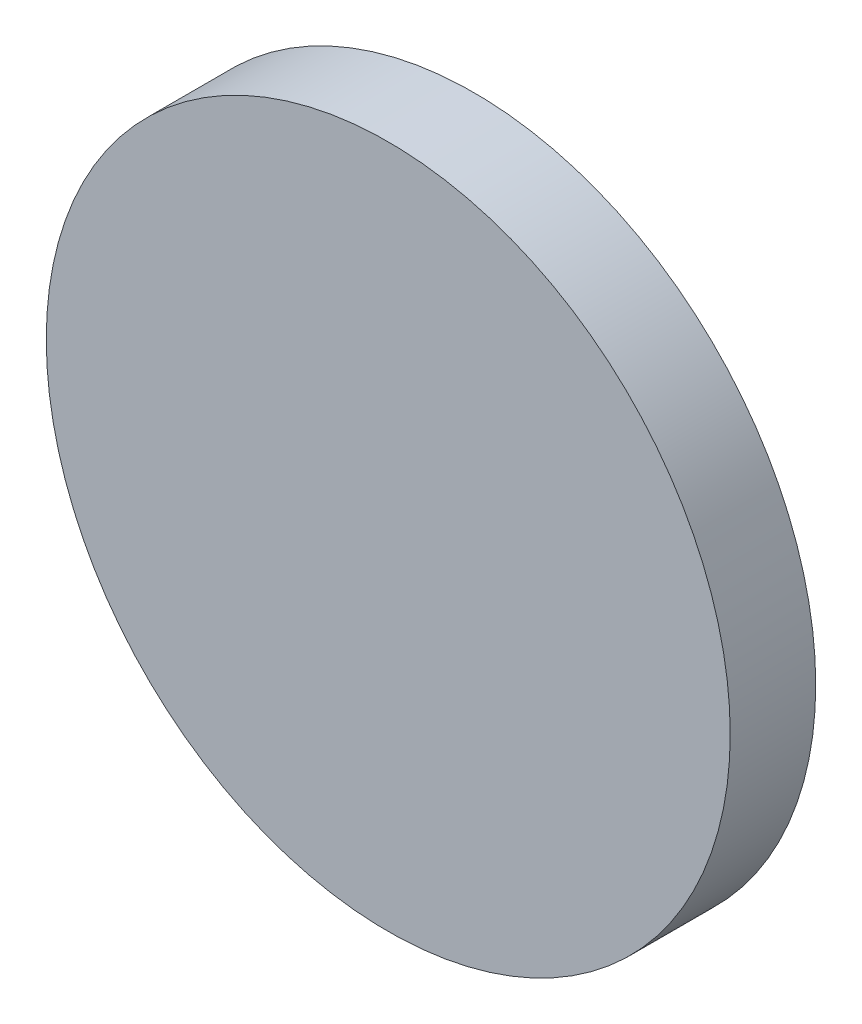
ISO-10303-21;
HEADER;
FILE_DESCRIPTION(('STEP AP214'),'2;1');
FILE_NAME('part.step','',(''),(''),'','','');
FILE_SCHEMA(('AUTOMOTIVE_DESIGN { 1 0 10303 214 1 1 1 1 }'));
ENDSEC;
DATA;
#1=APPLICATION_CONTEXT('core data for automotive mechanical design processes');
#2=APPLICATION_PROTOCOL_DEFINITION('international standard','automotive_design',2000,#1);
#3=PRODUCT_CONTEXT('',#1,'mechanical');
#4=PRODUCT('Part','Part','',(#3));
#5=PRODUCT_RELATED_PRODUCT_CATEGORY('part','',(#4));
#6=PRODUCT_DEFINITION_FORMATION('','',#4);
#7=PRODUCT_DEFINITION_CONTEXT('part definition',#1,'design');
#8=PRODUCT_DEFINITION('design','',#6,#7);
#9=PRODUCT_DEFINITION_SHAPE('','',#8);
#10=(LENGTH_UNIT() NAMED_UNIT(*) SI_UNIT(.MILLI.,.METRE.));
#11=(NAMED_UNIT(*) PLANE_ANGLE_UNIT() SI_UNIT($,.RADIAN.));
#12=(NAMED_UNIT(*) SI_UNIT($,.STERADIAN.) SOLID_ANGLE_UNIT());
#13=UNCERTAINTY_MEASURE_WITH_UNIT(LENGTH_MEASURE(1.E-05),#10,'distance_accuracy_value','');
#14=(GEOMETRIC_REPRESENTATION_CONTEXT(3) GLOBAL_UNCERTAINTY_ASSIGNED_CONTEXT((#13)) GLOBAL_UNIT_ASSIGNED_CONTEXT((#10,
#11,#12)) REPRESENTATION_CONTEXT('',''));
#15=CARTESIAN_POINT('',(0.,0.,0.));
#16=DIRECTION('',(0.,0.,1.));
#17=DIRECTION('',(1.,0.,0.));
#18=AXIS2_PLACEMENT_3D('',#15,#16,#17);
#19=CARTESIAN_POINT('',(0.,0.,0.79375));
#20=DIRECTION('',(0.,0.,-1.));
#21=DIRECTION('',(-1.,0.,0.));
#22=AXIS2_PLACEMENT_3D('',#19,#20,#21);
#23=CYLINDRICAL_SURFACE('',#22,3.175);
#24=CARTESIAN_POINT('',(0.,0.,0.79375));
#25=DIRECTION('',(0.,0.,1.));
#26=DIRECTION('',(1.,0.,0.));
#27=AXIS2_PLACEMENT_3D('',#24,#25,#26);
#28=CIRCLE('',#27,3.175);
#29=CARTESIAN_POINT('',(3.175,0.,0.79375));
#30=VERTEX_POINT('',#29);
#31=EDGE_CURVE('E10',#30,#30,#28,.T.);
#32=ORIENTED_EDGE('',*,*,#31,.F.);
#33=EDGE_LOOP('',(#32));
#34=FACE_BOUND('',#33,.T.);
#35=CARTESIAN_POINT('',(0.,0.,0.));
#36=DIRECTION('',(0.,0.,1.));
#37=DIRECTION('',(1.,0.,0.));
#38=AXIS2_PLACEMENT_3D('',#35,#36,#37);
#39=CIRCLE('',#38,3.175);
#40=CARTESIAN_POINT('',(3.175,0.,0.));
#41=VERTEX_POINT('',#40);
#42=EDGE_CURVE('E34',#41,#41,#39,.T.);
#43=ORIENTED_EDGE('',*,*,#42,.T.);
#44=EDGE_LOOP('',(#43));
#45=FACE_BOUND('',#44,.T.);
#46=ADVANCED_FACE('F31',(#34,#45),#23,.T.);
#47=CARTESIAN_POINT('',(0.,0.,0.79375));
#48=DIRECTION('',(0.,0.,1.));
#49=DIRECTION('',(1.,0.,0.));
#50=AXIS2_PLACEMENT_3D('',#47,#48,#49);
#51=PLANE('',#50);
#52=ORIENTED_EDGE('',*,*,#31,.T.);
#53=EDGE_LOOP('',(#52));
#54=FACE_BOUND('',#53,.T.);
#55=ADVANCED_FACE('F46',(#54),#51,.T.);
#56=CARTESIAN_POINT('',(0.,0.,0.));
#57=DIRECTION('',(0.,0.,1.));
#58=DIRECTION('',(1.,0.,0.));
#59=AXIS2_PLACEMENT_3D('',#56,#57,#58);
#60=PLANE('',#59);
#61=ORIENTED_EDGE('',*,*,#42,.F.);
#62=EDGE_LOOP('',(#61));
#63=FACE_BOUND('',#62,.T.);
#64=ADVANCED_FACE('F44',(#63),#60,.F.);
#65=CLOSED_SHELL('',(#46,#55,#64));
#66=MANIFOLD_SOLID_BREP('B2',#65);
#67=ADVANCED_BREP_SHAPE_REPRESENTATION('',(#18,#66),#14);
#68=SHAPE_DEFINITION_REPRESENTATION(#9,#67);
ENDSEC;
END-ISO-10303-21;
